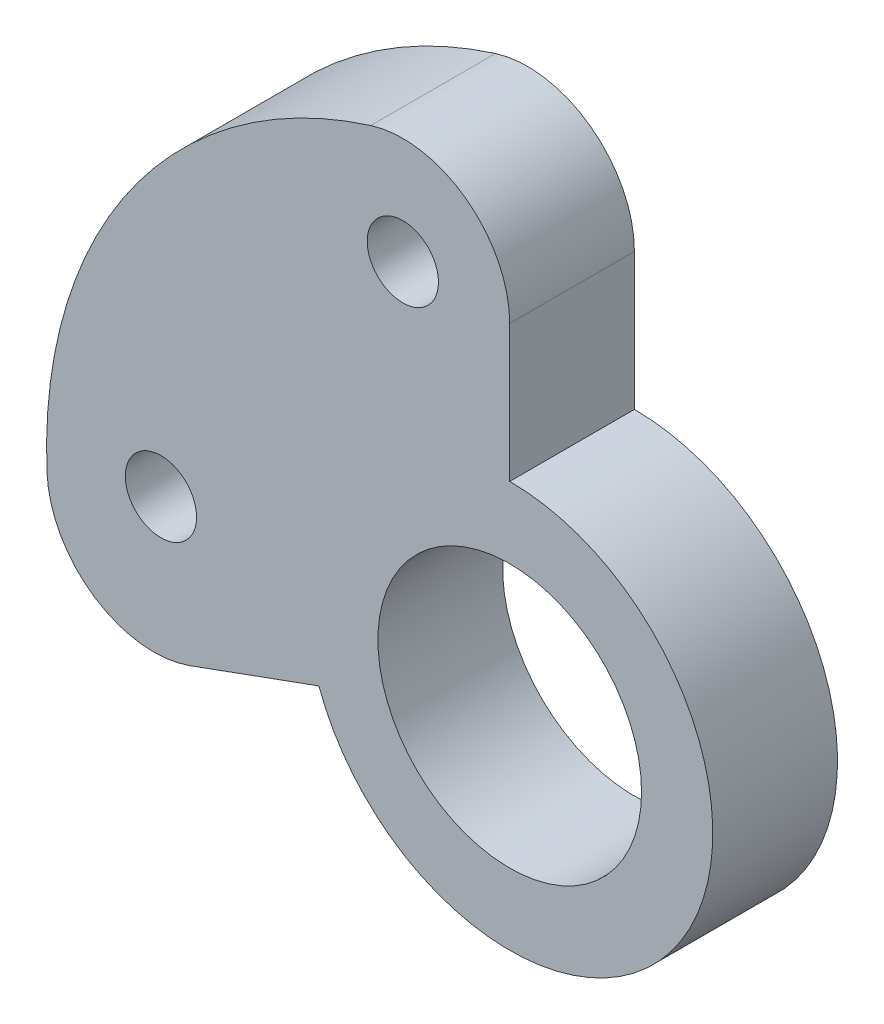
ISO-10303-21;
HEADER;
FILE_DESCRIPTION(('STEP AP214'),'2;1');
FILE_NAME('part.step','',(''),(''),'','','');
FILE_SCHEMA(('AUTOMOTIVE_DESIGN { 1 0 10303 214 1 1 1 1 }'));
ENDSEC;
DATA;
#1=APPLICATION_CONTEXT('core data for automotive mechanical design processes');
#2=APPLICATION_PROTOCOL_DEFINITION('international standard','automotive_design',2000,#1);
#3=PRODUCT_CONTEXT('',#1,'mechanical');
#4=PRODUCT('Part','Part','',(#3));
#5=PRODUCT_RELATED_PRODUCT_CATEGORY('part','',(#4));
#6=PRODUCT_DEFINITION_FORMATION('','',#4);
#7=PRODUCT_DEFINITION_CONTEXT('part definition',#1,'design');
#8=PRODUCT_DEFINITION('design','',#6,#7);
#9=PRODUCT_DEFINITION_SHAPE('','',#8);
#10=(LENGTH_UNIT() NAMED_UNIT(*) SI_UNIT(.MILLI.,.METRE.));
#11=(NAMED_UNIT(*) PLANE_ANGLE_UNIT() SI_UNIT($,.RADIAN.));
#12=(NAMED_UNIT(*) SI_UNIT($,.STERADIAN.) SOLID_ANGLE_UNIT());
#13=UNCERTAINTY_MEASURE_WITH_UNIT(LENGTH_MEASURE(1.E-05),#10,'distance_accuracy_value','');
#14=(GEOMETRIC_REPRESENTATION_CONTEXT(3) GLOBAL_UNCERTAINTY_ASSIGNED_CONTEXT((#13)) GLOBAL_UNIT_ASSIGNED_CONTEXT((#10,
#11,#12)) REPRESENTATION_CONTEXT('',''));
#15=CARTESIAN_POINT('',(0.,0.,0.));
#16=DIRECTION('',(0.,0.,1.));
#17=DIRECTION('',(1.,0.,0.));
#18=AXIS2_PLACEMENT_3D('',#15,#16,#17);
#19=CARTESIAN_POINT('',(0.,0.,3.5));
#20=DIRECTION('',(0.,0.,-1.));
#21=DIRECTION('',(-1.,0.,0.));
#22=AXIS2_PLACEMENT_3D('',#19,#20,#21);
#23=CYLINDRICAL_SURFACE('',#22,13.);
#24=CARTESIAN_POINT('',(0.,0.,0.));
#25=DIRECTION('',(0.,0.,1.));
#26=DIRECTION('',(1.,0.,0.));
#27=AXIS2_PLACEMENT_3D('',#24,#25,#26);
#28=CIRCLE('',#27,13.);
#29=CARTESIAN_POINT('',(-3.9,12.4012096184203,0.));
#30=VERTEX_POINT('',#29);
#31=CARTESIAN_POINT('',(-12.9872037262189,-0.576662270038601,0.));
#32=VERTEX_POINT('',#31);
#33=EDGE_CURVE('E128',#30,#32,#28,.T.);
#34=ORIENTED_EDGE('',*,*,#33,.T.);
#35=DIRECTION('',(0.,0.,-1.));
#36=VECTOR('',#35,1.);
#37=CARTESIAN_POINT('',(-12.9872037262189,-0.576662270038601,3.5));
#38=LINE('',#37,#36);
#39=CARTESIAN_POINT('',(-12.9872037262189,-0.576662270038601,3.5));
#40=VERTEX_POINT('',#39);
#41=EDGE_CURVE('E141',#32,#40,#38,.F.);
#42=ORIENTED_EDGE('',*,*,#41,.T.);
#43=CARTESIAN_POINT('',(0.,0.,3.5));
#44=DIRECTION('',(0.,0.,1.));
#45=DIRECTION('',(1.,0.,0.));
#46=AXIS2_PLACEMENT_3D('',#43,#44,#45);
#47=CIRCLE('',#46,13.);
#48=CARTESIAN_POINT('',(-3.9,12.4012096184203,3.5));
#49=VERTEX_POINT('',#48);
#50=EDGE_CURVE('E127',#49,#40,#47,.T.);
#51=ORIENTED_EDGE('',*,*,#50,.F.);
#52=DIRECTION('',(0.,0.,-1.));
#53=VECTOR('',#52,1.);
#54=CARTESIAN_POINT('',(-3.9,12.4012096184203,3.5));
#55=LINE('',#54,#53);
#56=EDGE_CURVE('E139',#49,#30,#55,.T.);
#57=ORIENTED_EDGE('',*,*,#56,.T.);
#58=EDGE_LOOP('',(#34,#42,#51,#57));
#59=FACE_BOUND('',#58,.T.);
#60=ADVANCED_FACE('F41',(#59),#23,.T.);
#61=CARTESIAN_POINT('',(0.,0.,3.5));
#62=DIRECTION('',(0.,0.,1.));
#63=DIRECTION('',(1.,0.,0.));
#64=AXIS2_PLACEMENT_3D('',#61,#62,#63);
#65=PLANE('',#64);
#66=CARTESIAN_POINT('',(-9.79035357822655,0.434714634336928,3.5));
#67=DIRECTION('',(0.,0.,1.));
#68=DIRECTION('',(1.,0.,0.));
#69=AXIS2_PLACEMENT_3D('',#66,#67,#68);
#70=CIRCLE('',#69,1.);
#71=CARTESIAN_POINT('',(-8.79035357822655,0.434714634336928,3.5));
#72=VERTEX_POINT('',#71);
#73=EDGE_CURVE('E243',#72,#72,#70,.T.);
#74=ORIENTED_EDGE('',*,*,#73,.F.);
#75=EDGE_LOOP('',(#74));
#76=FACE_BOUND('',#75,.T.);
#77=CARTESIAN_POINT('',(-3.,9.53939201416946,3.5));
#78=DIRECTION('',(0.,0.,1.));
#79=DIRECTION('',(1.,0.,0.));
#80=AXIS2_PLACEMENT_3D('',#77,#78,#79);
#81=CIRCLE('',#80,1.);
#82=CARTESIAN_POINT('',(-2.,9.53939201416946,3.5));
#83=VERTEX_POINT('',#82);
#84=EDGE_CURVE('E113',#83,#83,#81,.T.);
#85=ORIENTED_EDGE('',*,*,#84,.F.);
#86=EDGE_LOOP('',(#85));
#87=FACE_BOUND('',#86,.T.);
#88=CARTESIAN_POINT('',(0.,0.,3.5));
#89=DIRECTION('',(0.,0.,1.));
#90=DIRECTION('',(1.,0.,0.));
#91=AXIS2_PLACEMENT_3D('',#88,#89,#90);
#92=CIRCLE('',#91,3.7);
#93=CARTESIAN_POINT('',(3.7,0.,3.5));
#94=VERTEX_POINT('',#93);
#95=EDGE_CURVE('E124',#94,#94,#92,.T.);
#96=ORIENTED_EDGE('',*,*,#95,.F.);
#97=EDGE_LOOP('',(#96));
#98=FACE_BOUND('',#97,.T.);
#99=ORIENTED_EDGE('',*,*,#50,.T.);
#100=CARTESIAN_POINT('',(-9.99015671247608,-0.443586361568155,3.5));
#101=DIRECTION('',(0.,0.,1.));
#102=DIRECTION('',(1.,0.,0.));
#103=AXIS2_PLACEMENT_3D('',#100,#101,#102);
#104=CIRCLE('',#103,3.);
#105=CARTESIAN_POINT('',(-8.96409628249909,-3.26266422392589,3.5));
#106=VERTEX_POINT('',#105);
#107=EDGE_CURVE('E117',#40,#106,#104,.T.);
#108=ORIENTED_EDGE('',*,*,#107,.T.);
#109=DIRECTION('',(-0.939692620785912,-0.342020143325659,0.));
#110=VECTOR('',#109,1.);
#111=CARTESIAN_POINT('',(0.,0.,3.5));
#112=LINE('',#111,#110);
#113=CARTESIAN_POINT('',(-5.3562479384797,-1.94951481695626,3.5));
#114=VERTEX_POINT('',#113);
#115=EDGE_CURVE('E99',#114,#106,#112,.T.);
#116=ORIENTED_EDGE('',*,*,#115,.F.);
#117=CARTESIAN_POINT('',(0.,0.,3.5));
#118=DIRECTION('',(0.,0.,1.));
#119=DIRECTION('',(1.,0.,0.));
#120=AXIS2_PLACEMENT_3D('',#117,#118,#119);
#121=CIRCLE('',#120,5.7);
#122=CARTESIAN_POINT('',(0.,5.7,3.5));
#123=VERTEX_POINT('',#122);
#124=EDGE_CURVE('E107',#114,#123,#121,.T.);
#125=ORIENTED_EDGE('',*,*,#124,.T.);
#126=DIRECTION('',(0.,1.,0.));
#127=VECTOR('',#126,1.);
#128=CARTESIAN_POINT('',(0.,0.,3.5));
#129=LINE('',#128,#127);
#130=CARTESIAN_POINT('',(0.,9.53939201416946,3.5));
#131=VERTEX_POINT('',#130);
#132=EDGE_CURVE('E104',#123,#131,#129,.T.);
#133=ORIENTED_EDGE('',*,*,#132,.T.);
#134=CARTESIAN_POINT('',(-3.,9.53939201416946,3.5));
#135=DIRECTION('',(0.,0.,1.));
#136=DIRECTION('',(1.,0.,0.));
#137=AXIS2_PLACEMENT_3D('',#134,#135,#136);
#138=CIRCLE('',#137,3.);
#139=EDGE_CURVE('E144',#131,#49,#138,.T.);
#140=ORIENTED_EDGE('',*,*,#139,.T.);
#141=EDGE_LOOP('',(#99,#108,#116,#125,#133,#140));
#142=FACE_BOUND('',#141,.T.);
#143=ADVANCED_FACE('F116',(#76,#87,#98,#142),#65,.T.);
#144=CARTESIAN_POINT('',(0.,0.,0.));
#145=DIRECTION('',(0.,0.,1.));
#146=DIRECTION('',(1.,0.,0.));
#147=AXIS2_PLACEMENT_3D('',#144,#145,#146);
#148=PLANE('',#147);
#149=CARTESIAN_POINT('',(-3.00000000000001,9.53939201416947,0.));
#150=DIRECTION('',(0.,0.,1.));
#151=DIRECTION('',(1.,0.,0.));
#152=AXIS2_PLACEMENT_3D('',#149,#150,#151);
#153=CIRCLE('',#152,2.);
#154=CARTESIAN_POINT('',(-1.00000000000001,9.53939201416947,0.));
#155=VERTEX_POINT('',#154);
#156=EDGE_CURVE('E11',#155,#155,#153,.F.);
#157=ORIENTED_EDGE('',*,*,#156,.F.);
#158=EDGE_LOOP('',(#157));
#159=FACE_BOUND('',#158,.T.);
#160=CARTESIAN_POINT('',(-9.79035357822655,0.434714634336933,0.));
#161=DIRECTION('',(0.,0.,1.));
#162=DIRECTION('',(1.,0.,0.));
#163=AXIS2_PLACEMENT_3D('',#160,#161,#162);
#164=CIRCLE('',#163,2.);
#165=CARTESIAN_POINT('',(-7.79035357822655,0.434714634336933,0.));
#166=VERTEX_POINT('',#165);
#167=EDGE_CURVE('E49',#166,#166,#164,.F.);
#168=ORIENTED_EDGE('',*,*,#167,.F.);
#169=EDGE_LOOP('',(#168));
#170=FACE_BOUND('',#169,.T.);
#171=CARTESIAN_POINT('',(0.,0.,0.));
#172=DIRECTION('',(0.,0.,1.));
#173=DIRECTION('',(1.,0.,0.));
#174=AXIS2_PLACEMENT_3D('',#171,#172,#173);
#175=CIRCLE('',#174,3.7);
#176=CARTESIAN_POINT('',(3.7,0.,0.));
#177=VERTEX_POINT('',#176);
#178=EDGE_CURVE('E122',#177,#177,#175,.T.);
#179=ORIENTED_EDGE('',*,*,#178,.T.);
#180=EDGE_LOOP('',(#179));
#181=FACE_BOUND('',#180,.T.);
#182=DIRECTION('',(-0.939692620785912,-0.342020143325659,0.));
#183=VECTOR('',#182,1.);
#184=CARTESIAN_POINT('',(0.,0.,0.));
#185=LINE('',#184,#183);
#186=CARTESIAN_POINT('',(-5.3562479384797,-1.94951481695626,0.));
#187=VERTEX_POINT('',#186);
#188=CARTESIAN_POINT('',(-8.9640962824991,-3.26266422392589,0.));
#189=VERTEX_POINT('',#188);
#190=EDGE_CURVE('E100',#187,#189,#185,.T.);
#191=ORIENTED_EDGE('',*,*,#190,.T.);
#192=CARTESIAN_POINT('',(-9.99015671247608,-0.443586361568155,0.));
#193=DIRECTION('',(0.,0.,1.));
#194=DIRECTION('',(1.,0.,0.));
#195=AXIS2_PLACEMENT_3D('',#192,#193,#194);
#196=CIRCLE('',#195,3.);
#197=EDGE_CURVE('E149',#189,#32,#196,.F.);
#198=ORIENTED_EDGE('',*,*,#197,.T.);
#199=ORIENTED_EDGE('',*,*,#33,.F.);
#200=CARTESIAN_POINT('',(-3.,9.53939201416946,0.));
#201=DIRECTION('',(0.,0.,1.));
#202=DIRECTION('',(1.,0.,0.));
#203=AXIS2_PLACEMENT_3D('',#200,#201,#202);
#204=CIRCLE('',#203,3.);
#205=CARTESIAN_POINT('',(0.,9.53939201416946,0.));
#206=VERTEX_POINT('',#205);
#207=EDGE_CURVE('E56',#30,#206,#204,.F.);
#208=ORIENTED_EDGE('',*,*,#207,.T.);
#209=DIRECTION('',(0.,1.,0.));
#210=VECTOR('',#209,1.);
#211=CARTESIAN_POINT('',(0.,0.,0.));
#212=LINE('',#211,#210);
#213=CARTESIAN_POINT('',(0.,5.7,0.));
#214=VERTEX_POINT('',#213);
#215=EDGE_CURVE('E137',#214,#206,#212,.T.);
#216=ORIENTED_EDGE('',*,*,#215,.F.);
#217=CARTESIAN_POINT('',(0.,0.,0.));
#218=DIRECTION('',(0.,0.,1.));
#219=DIRECTION('',(1.,0.,0.));
#220=AXIS2_PLACEMENT_3D('',#217,#218,#219);
#221=CIRCLE('',#220,5.7);
#222=EDGE_CURVE('E135',#187,#214,#221,.T.);
#223=ORIENTED_EDGE('',*,*,#222,.F.);
#224=EDGE_LOOP('',(#191,#198,#199,#208,#216,#223));
#225=FACE_BOUND('',#224,.T.);
#226=ADVANCED_FACE('F158',(#159,#170,#181,#225),#148,.F.);
#227=CARTESIAN_POINT('',(0.,0.,3.5));
#228=DIRECTION('',(0.,0.,-1.));
#229=DIRECTION('',(-1.,0.,0.));
#230=AXIS2_PLACEMENT_3D('',#227,#228,#229);
#231=CYLINDRICAL_SURFACE('',#230,3.7);
#232=ORIENTED_EDGE('',*,*,#95,.T.);
#233=EDGE_LOOP('',(#232));
#234=FACE_BOUND('',#233,.T.);
#235=ORIENTED_EDGE('',*,*,#178,.F.);
#236=EDGE_LOOP('',(#235));
#237=FACE_BOUND('',#236,.T.);
#238=ADVANCED_FACE('F161',(#234,#237),#231,.F.);
#239=CARTESIAN_POINT('',(0.,0.,-6.5));
#240=DIRECTION('',(0.,0.,1.));
#241=DIRECTION('',(1.,0.,0.));
#242=AXIS2_PLACEMENT_3D('',#239,#240,#241);
#243=CYLINDRICAL_SURFACE('',#242,5.7);
#244=ORIENTED_EDGE('',*,*,#222,.T.);
#245=DIRECTION('',(0.,0.,1.));
#246=VECTOR('',#245,1.);
#247=CARTESIAN_POINT('',(0.,5.7,-6.5));
#248=LINE('',#247,#246);
#249=EDGE_CURVE('E103',#214,#123,#248,.T.);
#250=ORIENTED_EDGE('',*,*,#249,.T.);
#251=ORIENTED_EDGE('',*,*,#124,.F.);
#252=DIRECTION('',(0.,0.,1.));
#253=VECTOR('',#252,1.);
#254=CARTESIAN_POINT('',(-5.3562479384797,-1.94951481695626,-6.5));
#255=LINE('',#254,#253);
#256=EDGE_CURVE('E95',#187,#114,#255,.T.);
#257=ORIENTED_EDGE('',*,*,#256,.F.);
#258=EDGE_LOOP('',(#244,#250,#251,#257));
#259=FACE_BOUND('',#258,.T.);
#260=ADVANCED_FACE('F108',(#259),#243,.T.);
#261=CARTESIAN_POINT('',(0.,0.,-6.5));
#262=DIRECTION('',(1.,0.,0.));
#263=DIRECTION('',(0.,0.,-1.));
#264=AXIS2_PLACEMENT_3D('',#261,#262,#263);
#265=PLANE('',#264);
#266=ORIENTED_EDGE('',*,*,#215,.T.);
#267=DIRECTION('',(0.,0.,1.));
#268=VECTOR('',#267,1.);
#269=CARTESIAN_POINT('',(0.,9.53939201416946,3.5));
#270=LINE('',#269,#268);
#271=EDGE_CURVE('E151',#206,#131,#270,.T.);
#272=ORIENTED_EDGE('',*,*,#271,.T.);
#273=ORIENTED_EDGE('',*,*,#132,.F.);
#274=ORIENTED_EDGE('',*,*,#249,.F.);
#275=EDGE_LOOP('',(#266,#272,#273,#274));
#276=FACE_BOUND('',#275,.T.);
#277=ADVANCED_FACE('F175',(#276),#265,.T.);
#278=CARTESIAN_POINT('',(0.,0.,-6.5));
#279=DIRECTION('',(-0.342020143325659,0.939692620785912,0.));
#280=DIRECTION('',(-0.939692620785912,-0.342020143325659,0.));
#281=AXIS2_PLACEMENT_3D('',#278,#279,#280);
#282=PLANE('',#281);
#283=ORIENTED_EDGE('',*,*,#115,.T.);
#284=DIRECTION('',(0.,0.,-1.));
#285=VECTOR('',#284,1.);
#286=CARTESIAN_POINT('',(-8.9640962824991,-3.26266422392589,-6.5));
#287=LINE('',#286,#285);
#288=EDGE_CURVE('E64',#106,#189,#287,.T.);
#289=ORIENTED_EDGE('',*,*,#288,.T.);
#290=ORIENTED_EDGE('',*,*,#190,.F.);
#291=ORIENTED_EDGE('',*,*,#256,.T.);
#292=EDGE_LOOP('',(#283,#289,#290,#291));
#293=FACE_BOUND('',#292,.T.);
#294=ADVANCED_FACE('F97',(#293),#282,.F.);
#295=CARTESIAN_POINT('',(-3.,9.53939201416946,-6.5));
#296=DIRECTION('',(0.,0.,1.));
#297=DIRECTION('',(1.,0.,0.));
#298=AXIS2_PLACEMENT_3D('',#295,#296,#297);
#299=CYLINDRICAL_SURFACE('',#298,1.);
#300=ORIENTED_EDGE('',*,*,#84,.T.);
#301=EDGE_LOOP('',(#300));
#302=FACE_BOUND('',#301,.T.);
#303=CARTESIAN_POINT('',(-3.00000000000001,9.53939201416947,-0.499999999998689));
#304=DIRECTION('',(0.,0.,-1.));
#305=DIRECTION('',(-1.00000000000005,0.,0.));
#306=AXIS2_PLACEMENT_3D('',#303,#304,#305);
#307=CIRCLE('',#306,1.);
#308=CARTESIAN_POINT('',(-4.00000000000006,9.53939201416947,-0.499999999998689));
#309=VERTEX_POINT('',#308);
#310=EDGE_CURVE('E230',#309,#309,#307,.F.);
#311=ORIENTED_EDGE('',*,*,#310,.F.);
#312=EDGE_LOOP('',(#311));
#313=FACE_BOUND('',#312,.T.);
#314=ADVANCED_FACE('F182',(#302,#313),#299,.F.);
#315=CARTESIAN_POINT('',(-9.79035357822655,0.434714634336928,-2.5));
#316=DIRECTION('',(0.,0.,1.));
#317=DIRECTION('',(1.,0.,0.));
#318=AXIS2_PLACEMENT_3D('',#315,#316,#317);
#319=CYLINDRICAL_SURFACE('',#318,1.);
#320=ORIENTED_EDGE('',*,*,#73,.T.);
#321=EDGE_LOOP('',(#320));
#322=FACE_BOUND('',#321,.T.);
#323=CARTESIAN_POINT('',(-9.79035357822655,0.434714634336933,-1.99999999999946));
#324=DIRECTION('',(0.,0.,-1.));
#325=DIRECTION('',(-1.00000000000002,0.,0.));
#326=AXIS2_PLACEMENT_3D('',#323,#324,#325);
#327=CIRCLE('',#326,1.);
#328=CARTESIAN_POINT('',(-10.7903535782266,0.434714634336933,-1.99999999999946));
#329=VERTEX_POINT('',#328);
#330=EDGE_CURVE('E234',#329,#329,#327,.F.);
#331=ORIENTED_EDGE('',*,*,#330,.F.);
#332=EDGE_LOOP('',(#331));
#333=FACE_BOUND('',#332,.T.);
#334=ADVANCED_FACE('F197',(#322,#333),#319,.F.);
#335=CARTESIAN_POINT('',(-9.99015671247608,-0.443586361568155,3.5));
#336=DIRECTION('',(0.,0.,-1.));
#337=DIRECTION('',(-1.,0.,0.));
#338=AXIS2_PLACEMENT_3D('',#335,#336,#337);
#339=CYLINDRICAL_SURFACE('',#338,3.);
#340=ORIENTED_EDGE('',*,*,#197,.F.);
#341=ORIENTED_EDGE('',*,*,#288,.F.);
#342=ORIENTED_EDGE('',*,*,#107,.F.);
#343=ORIENTED_EDGE('',*,*,#41,.F.);
#344=EDGE_LOOP('',(#340,#341,#342,#343));
#345=FACE_BOUND('',#344,.T.);
#346=ADVANCED_FACE('F168',(#345),#339,.T.);
#347=CARTESIAN_POINT('',(-3.,9.53939201416946,3.5));
#348=DIRECTION('',(0.,0.,-1.));
#349=DIRECTION('',(-1.,0.,0.));
#350=AXIS2_PLACEMENT_3D('',#347,#348,#349);
#351=CYLINDRICAL_SURFACE('',#350,3.);
#352=ORIENTED_EDGE('',*,*,#207,.F.);
#353=ORIENTED_EDGE('',*,*,#56,.F.);
#354=ORIENTED_EDGE('',*,*,#139,.F.);
#355=ORIENTED_EDGE('',*,*,#271,.F.);
#356=EDGE_LOOP('',(#352,#353,#354,#355));
#357=FACE_BOUND('',#356,.T.);
#358=ADVANCED_FACE('F43',(#357),#351,.T.);
#359=CARTESIAN_POINT('',(-9.79035357822655,0.434714634336933,-1.99999999999946));
#360=DIRECTION('',(0.,0.,1.));
#361=DIRECTION('',(1.,0.,0.));
#362=AXIS2_PLACEMENT_3D('',#359,#360,#361);
#363=CYLINDRICAL_SURFACE('',#362,2.);
#364=CARTESIAN_POINT('',(-9.79035357822655,0.434714634336933,-1.99999999999946));
#365=DIRECTION('',(0.,0.,-1.));
#366=DIRECTION('',(-1.00000000000002,0.,0.));
#367=AXIS2_PLACEMENT_3D('',#364,#365,#366);
#368=CIRCLE('',#367,2.);
#369=CARTESIAN_POINT('',(-11.7903535782266,0.434714634336933,-1.99999999999946));
#370=VERTEX_POINT('',#369);
#371=EDGE_CURVE('E237',#370,#370,#368,.T.);
#372=ORIENTED_EDGE('',*,*,#371,.F.);
#373=EDGE_LOOP('',(#372));
#374=FACE_BOUND('',#373,.T.);
#375=ORIENTED_EDGE('',*,*,#167,.T.);
#376=EDGE_LOOP('',(#375));
#377=FACE_BOUND('',#376,.T.);
#378=ADVANCED_FACE('F156',(#374,#377),#363,.T.);
#379=CARTESIAN_POINT('',(0.,0.,-2.));
#380=DIRECTION('',(0.,0.,-1.));
#381=DIRECTION('',(-1.00000000000002,0.,0.));
#382=AXIS2_PLACEMENT_3D('',#379,#380,#381);
#383=PLANE('',#382);
#384=ORIENTED_EDGE('',*,*,#330,.T.);
#385=EDGE_LOOP('',(#384));
#386=FACE_BOUND('',#385,.T.);
#387=ORIENTED_EDGE('',*,*,#371,.T.);
#388=EDGE_LOOP('',(#387));
#389=FACE_BOUND('',#388,.T.);
#390=ADVANCED_FACE('F213',(#386,#389),#383,.T.);
#391=CARTESIAN_POINT('',(-3.00000000000001,9.53939201416947,-0.499999999998689));
#392=DIRECTION('',(0.,0.,1.));
#393=DIRECTION('',(1.,0.,0.));
#394=AXIS2_PLACEMENT_3D('',#391,#392,#393);
#395=CYLINDRICAL_SURFACE('',#394,2.);
#396=CARTESIAN_POINT('',(-3.00000000000001,9.53939201416947,-0.499999999998689));
#397=DIRECTION('',(0.,0.,-1.));
#398=DIRECTION('',(-1.00000000000005,0.,0.));
#399=AXIS2_PLACEMENT_3D('',#396,#397,#398);
#400=CIRCLE('',#399,2.);
#401=CARTESIAN_POINT('',(-5.00000000000011,9.53939201416947,-0.499999999998689));
#402=VERTEX_POINT('',#401);
#403=EDGE_CURVE('E233',#402,#402,#400,.T.);
#404=ORIENTED_EDGE('',*,*,#403,.F.);
#405=EDGE_LOOP('',(#404));
#406=FACE_BOUND('',#405,.T.);
#407=ORIENTED_EDGE('',*,*,#156,.T.);
#408=EDGE_LOOP('',(#407));
#409=FACE_BOUND('',#408,.T.);
#410=ADVANCED_FACE('F217',(#406,#409),#395,.T.);
#411=CARTESIAN_POINT('',(0.,0.,-0.5));
#412=DIRECTION('',(0.,0.,-1.));
#413=DIRECTION('',(-1.00000000000005,0.,0.));
#414=AXIS2_PLACEMENT_3D('',#411,#412,#413);
#415=PLANE('',#414);
#416=ORIENTED_EDGE('',*,*,#310,.T.);
#417=EDGE_LOOP('',(#416));
#418=FACE_BOUND('',#417,.T.);
#419=ORIENTED_EDGE('',*,*,#403,.T.);
#420=EDGE_LOOP('',(#419));
#421=FACE_BOUND('',#420,.T.);
#422=ADVANCED_FACE('F221',(#418,#421),#415,.T.);
#423=CLOSED_SHELL('',(#60,#143,#226,#238,#260,#277,#294,#314,#334,#346,#358,#378,#390,#410,#422));
#424=MANIFOLD_SOLID_BREP('B2',#423);
#425=ADVANCED_BREP_SHAPE_REPRESENTATION('',(#18,#424),#14);
#426=SHAPE_DEFINITION_REPRESENTATION(#9,#425);
ENDSEC;
END-ISO-10303-21;
